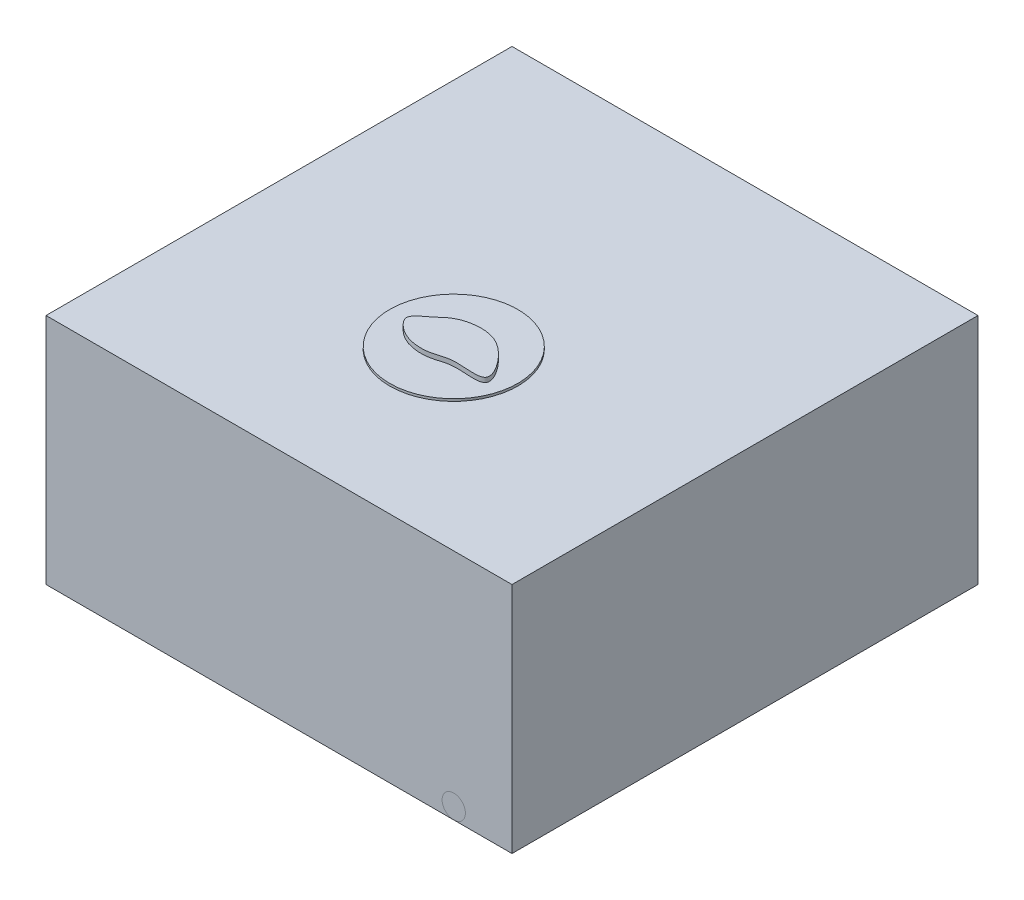
ISO-10303-21;
HEADER;
FILE_DESCRIPTION(('STEP AP214'),'2;1');
FILE_NAME('part.step','',(''),(''),'','','');
FILE_SCHEMA(('AUTOMOTIVE_DESIGN { 1 0 10303 214 1 1 1 1 }'));
ENDSEC;
DATA;
#1=APPLICATION_CONTEXT('core data for automotive mechanical design processes');
#2=APPLICATION_PROTOCOL_DEFINITION('international standard','automotive_design',2000,#1);
#3=PRODUCT_CONTEXT('',#1,'mechanical');
#4=PRODUCT('Part','Part','',(#3));
#5=PRODUCT_RELATED_PRODUCT_CATEGORY('part','',(#4));
#6=PRODUCT_DEFINITION_FORMATION('','',#4);
#7=PRODUCT_DEFINITION_CONTEXT('part definition',#1,'design');
#8=PRODUCT_DEFINITION('design','',#6,#7);
#9=PRODUCT_DEFINITION_SHAPE('','',#8);
#10=(LENGTH_UNIT() NAMED_UNIT(*) SI_UNIT(.MILLI.,.METRE.));
#11=(NAMED_UNIT(*) PLANE_ANGLE_UNIT() SI_UNIT($,.RADIAN.));
#12=(NAMED_UNIT(*) SI_UNIT($,.STERADIAN.) SOLID_ANGLE_UNIT());
#13=UNCERTAINTY_MEASURE_WITH_UNIT(LENGTH_MEASURE(1.E-05),#10,'distance_accuracy_value','');
#14=(GEOMETRIC_REPRESENTATION_CONTEXT(3) GLOBAL_UNCERTAINTY_ASSIGNED_CONTEXT((#13)) GLOBAL_UNIT_ASSIGNED_CONTEXT((#10,
#11,#12)) REPRESENTATION_CONTEXT('',''));
#15=CARTESIAN_POINT('',(0.,0.,0.));
#16=DIRECTION('',(0.,0.,1.));
#17=DIRECTION('',(1.,0.,0.));
#18=AXIS2_PLACEMENT_3D('',#15,#16,#17);
#19=CARTESIAN_POINT('',(-1.32978682457797,5.3,12.0470966404881));
#20=CARTESIAN_POINT('',(-1.56949938233388,5.3,12.2405123536894));
#21=CARTESIAN_POINT('',(-2.08614424851907,5.3,12.5391697720833));
#22=CARTESIAN_POINT('',(-1.58643209411403,5.3,13.1168891119311));
#23=CARTESIAN_POINT('',(-0.99479110722871,5.3,13.4609601521511));
#24=CARTESIAN_POINT('',(-0.122057096544853,5.3,13.5063472457396));
#25=CARTESIAN_POINT('',(0.780549472015395,5.3,13.1044677868928));
#26=CARTESIAN_POINT('',(2.65290980881673,5.3,13.5718372621998));
#27=CARTESIAN_POINT('',(1.37260667116618,5.3,11.7465735610997));
#28=CARTESIAN_POINT('',(0.251281573482777,5.3,11.3225744749199));
#29=CARTESIAN_POINT('',(-0.824147776626976,5.3,11.5489578340658));
#30=CARTESIAN_POINT('',(-1.19634203116918,5.3,11.9394246848268));
#31=CARTESIAN_POINT('',(-1.32978682457797,5.3,12.0470966404881));
#32=B_SPLINE_CURVE_WITH_KNOTS('',3,(#19,#20,#21,#22,#23,#24,#25,#26,#27,#28,#29,#30,#31),
.UNSPECIFIED.,.T.,.F.,(4,1,1,1,1,1,1,1,1,1,4),(0.,0.0890314863366276,0.133435272323839,
0.204833870138696,0.315562123210451,0.38661889368764,0.538438655581061,0.696738525235763,
0.817182112999442,0.95043735542146,1.),.UNSPECIFIED.);
#33=DIRECTION('',(0.,-1.,0.));
#34=VECTOR('',#33,1.);
#35=SURFACE_OF_LINEAR_EXTRUSION('',#32,#34);
#36=CARTESIAN_POINT('',(-1.32978682457797,5.3,12.0470966404881));
#37=VERTEX_POINT('',#36);
#38=EDGE_CURVE('E11',#37,#37,#32,.T.);
#39=ORIENTED_EDGE('',*,*,#38,.F.);
#40=EDGE_LOOP('',(#39));
#41=FACE_BOUND('',#40,.T.);
#42=CARTESIAN_POINT('',(-1.32978682457797,5.,12.0470966404881));
#43=CARTESIAN_POINT('',(-1.56949938233388,5.,12.2405123536894));
#44=CARTESIAN_POINT('',(-2.08614424851907,5.,12.5391697720833));
#45=CARTESIAN_POINT('',(-1.58643209411403,5.,13.1168891119311));
#46=CARTESIAN_POINT('',(-0.99479110722871,5.,13.4609601521511));
#47=CARTESIAN_POINT('',(-0.122057096544853,5.,13.5063472457396));
#48=CARTESIAN_POINT('',(0.780549472015395,5.,13.1044677868928));
#49=CARTESIAN_POINT('',(2.65290980881673,5.,13.5718372621998));
#50=CARTESIAN_POINT('',(1.37260667116618,5.,11.7465735610997));
#51=CARTESIAN_POINT('',(0.251281573482777,5.,11.3225744749199));
#52=CARTESIAN_POINT('',(-0.824147776626976,5.,11.5489578340658));
#53=CARTESIAN_POINT('',(-1.19634203116918,5.,11.9394246848268));
#54=CARTESIAN_POINT('',(-1.32978682457797,5.,12.0470966404881));
#55=B_SPLINE_CURVE_WITH_KNOTS('',3,(#42,#43,#44,#45,#46,#47,#48,#49,#50,#51,#52,#53,#54),
.UNSPECIFIED.,.T.,.F.,(4,1,1,1,1,1,1,1,1,1,4),(0.,0.0890314863366276,0.133435272323839,
0.204833870138696,0.315562123210451,0.38661889368764,0.538438655581061,0.696738525235763,
0.817182112999442,0.95043735542146,1.),.UNSPECIFIED.);
#56=CARTESIAN_POINT('',(-1.32978682457797,5.,12.0470966404881));
#57=VERTEX_POINT('',#56);
#58=EDGE_CURVE('E45',#57,#57,#55,.T.);
#59=ORIENTED_EDGE('',*,*,#58,.T.);
#60=EDGE_LOOP('',(#59));
#61=FACE_BOUND('',#60,.T.);
#62=ADVANCED_FACE('F41',(#41,#61),#35,.F.);
#63=CARTESIAN_POINT('',(1.81422588975815,5.3,13.257386496687));
#64=DIRECTION('',(0.,-1.,0.));
#65=DIRECTION('',(0.,0.,-1.));
#66=AXIS2_PLACEMENT_3D('',#63,#64,#65);
#67=PLANE('',#66);
#68=ORIENTED_EDGE('',*,*,#38,.T.);
#69=EDGE_LOOP('',(#68));
#70=FACE_BOUND('',#69,.T.);
#71=ADVANCED_FACE('F64',(#70),#67,.F.);
#72=CARTESIAN_POINT('',(1.81422588975815,5.,13.257386496687));
#73=DIRECTION('',(0.,-1.,0.));
#74=DIRECTION('',(0.,0.,-1.));
#75=AXIS2_PLACEMENT_3D('',#72,#73,#74);
#76=PLANE('',#75);
#77=ORIENTED_EDGE('',*,*,#58,.F.);
#78=EDGE_LOOP('',(#77));
#79=FACE_BOUND('',#78,.T.);
#80=ADVANCED_FACE('F62',(#79),#76,.T.);
#81=CLOSED_SHELL('',(#62,#71,#80));
#82=MANIFOLD_SOLID_BREP('B2',#81);
#83=CARTESIAN_POINT('',(0.5,5.,12.5));
#84=DIRECTION('',(0.,1.,0.));
#85=DIRECTION('',(0.,0.,1.));
#86=AXIS2_PLACEMENT_3D('',#83,#84,#85);
#87=CYLINDRICAL_SURFACE('',#86,0.00500000000000103);
#88=CARTESIAN_POINT('',(0.5,5.,12.5));
#89=DIRECTION('',(0.,-1.,0.));
#90=DIRECTION('',(0.,0.,1.));
#91=AXIS2_PLACEMENT_3D('',#88,#89,#90);
#92=CIRCLE('',#91,0.00500000000000103);
#93=CARTESIAN_POINT('',(0.5,5.,12.505));
#94=VERTEX_POINT('',#93);
#95=EDGE_CURVE('E40',#94,#94,#92,.T.);
#96=ORIENTED_EDGE('',*,*,#95,.F.);
#97=EDGE_LOOP('',(#96));
#98=FACE_BOUND('',#97,.T.);
#99=CARTESIAN_POINT('',(0.5,5.1,12.5));
#100=DIRECTION('',(0.,-1.,0.));
#101=DIRECTION('',(0.,0.,1.));
#102=AXIS2_PLACEMENT_3D('',#99,#100,#101);
#103=CIRCLE('',#102,0.00500000000000103);
#104=CARTESIAN_POINT('',(0.5,5.1,12.505));
#105=VERTEX_POINT('',#104);
#106=EDGE_CURVE('E103',#105,#105,#103,.T.);
#107=ORIENTED_EDGE('',*,*,#106,.T.);
#108=EDGE_LOOP('',(#107));
#109=FACE_BOUND('',#108,.T.);
#110=ADVANCED_FACE('F100',(#98,#109),#87,.T.);
#111=CARTESIAN_POINT('',(0.5,5.,12.5));
#112=DIRECTION('',(0.,1.,0.));
#113=DIRECTION('',(0.,0.,1.));
#114=AXIS2_PLACEMENT_3D('',#111,#112,#113);
#115=PLANE('',#114);
#116=ORIENTED_EDGE('',*,*,#95,.T.);
#117=EDGE_LOOP('',(#116));
#118=FACE_BOUND('',#117,.T.);
#119=ADVANCED_FACE('F115',(#118),#115,.F.);
#120=CARTESIAN_POINT('',(0.5,5.1,12.5));
#121=DIRECTION('',(0.,1.,0.));
#122=DIRECTION('',(0.,0.,1.));
#123=AXIS2_PLACEMENT_3D('',#120,#121,#122);
#124=PLANE('',#123);
#125=ORIENTED_EDGE('',*,*,#106,.F.);
#126=EDGE_LOOP('',(#125));
#127=FACE_BOUND('',#126,.T.);
#128=ADVANCED_FACE('F113',(#127),#124,.T.);
#129=CLOSED_SHELL('',(#110,#119,#128));
#130=MANIFOLD_SOLID_BREP('B6',#129);
#131=CARTESIAN_POINT('',(0.499999999999998,5.,12.));
#132=DIRECTION('',(0.,1.,0.));
#133=DIRECTION('',(0.,0.,1.));
#134=AXIS2_PLACEMENT_3D('',#131,#132,#133);
#135=CYLINDRICAL_SURFACE('',#134,0.00499999999999896);
#136=CARTESIAN_POINT('',(0.499999999999998,5.,12.));
#137=DIRECTION('',(0.,-1.,0.));
#138=DIRECTION('',(0.,0.,1.));
#139=AXIS2_PLACEMENT_3D('',#136,#137,#138);
#140=CIRCLE('',#139,0.00499999999999896);
#141=CARTESIAN_POINT('',(0.499999999999998,5.,12.005));
#142=VERTEX_POINT('',#141);
#143=EDGE_CURVE('E99',#142,#142,#140,.T.);
#144=ORIENTED_EDGE('',*,*,#143,.F.);
#145=EDGE_LOOP('',(#144));
#146=FACE_BOUND('',#145,.T.);
#147=CARTESIAN_POINT('',(0.499999999999998,5.1,12.));
#148=DIRECTION('',(0.,-1.,0.));
#149=DIRECTION('',(0.,0.,1.));
#150=AXIS2_PLACEMENT_3D('',#147,#148,#149);
#151=CIRCLE('',#150,0.00499999999999896);
#152=CARTESIAN_POINT('',(0.499999999999998,5.1,12.005));
#153=VERTEX_POINT('',#152);
#154=EDGE_CURVE('E151',#153,#153,#151,.T.);
#155=ORIENTED_EDGE('',*,*,#154,.T.);
#156=EDGE_LOOP('',(#155));
#157=FACE_BOUND('',#156,.T.);
#158=ADVANCED_FACE('F148',(#146,#157),#135,.T.);
#159=CARTESIAN_POINT('',(0.499999999999998,5.,12.));
#160=DIRECTION('',(0.,1.,0.));
#161=DIRECTION('',(0.,0.,1.));
#162=AXIS2_PLACEMENT_3D('',#159,#160,#161);
#163=PLANE('',#162);
#164=ORIENTED_EDGE('',*,*,#143,.T.);
#165=EDGE_LOOP('',(#164));
#166=FACE_BOUND('',#165,.T.);
#167=ADVANCED_FACE('F163',(#166),#163,.F.);
#168=CARTESIAN_POINT('',(0.499999999999998,5.1,12.));
#169=DIRECTION('',(0.,1.,0.));
#170=DIRECTION('',(0.,0.,1.));
#171=AXIS2_PLACEMENT_3D('',#168,#169,#170);
#172=PLANE('',#171);
#173=ORIENTED_EDGE('',*,*,#154,.F.);
#174=EDGE_LOOP('',(#173));
#175=FACE_BOUND('',#174,.T.);
#176=ADVANCED_FACE('F161',(#175),#172,.T.);
#177=CLOSED_SHELL('',(#158,#167,#176));
#178=MANIFOLD_SOLID_BREP('B35',#177);
#179=CARTESIAN_POINT('',(0.499999999999998,5.,13.));
#180=DIRECTION('',(0.,1.,0.));
#181=DIRECTION('',(0.,0.,1.));
#182=AXIS2_PLACEMENT_3D('',#179,#180,#181);
#183=CYLINDRICAL_SURFACE('',#182,0.00500000000000103);
#184=CARTESIAN_POINT('',(0.499999999999998,5.,13.));
#185=DIRECTION('',(0.,-1.,0.));
#186=DIRECTION('',(0.,0.,-1.));
#187=AXIS2_PLACEMENT_3D('',#184,#185,#186);
#188=CIRCLE('',#187,0.00500000000000103);
#189=CARTESIAN_POINT('',(0.499999999999998,5.,12.995));
#190=VERTEX_POINT('',#189);
#191=EDGE_CURVE('E147',#190,#190,#188,.T.);
#192=ORIENTED_EDGE('',*,*,#191,.F.);
#193=EDGE_LOOP('',(#192));
#194=FACE_BOUND('',#193,.T.);
#195=CARTESIAN_POINT('',(0.499999999999998,5.1,13.));
#196=DIRECTION('',(0.,-1.,0.));
#197=DIRECTION('',(0.,0.,-1.));
#198=AXIS2_PLACEMENT_3D('',#195,#196,#197);
#199=CIRCLE('',#198,0.00500000000000103);
#200=CARTESIAN_POINT('',(0.499999999999998,5.1,12.995));
#201=VERTEX_POINT('',#200);
#202=EDGE_CURVE('E199',#201,#201,#199,.T.);
#203=ORIENTED_EDGE('',*,*,#202,.T.);
#204=EDGE_LOOP('',(#203));
#205=FACE_BOUND('',#204,.T.);
#206=ADVANCED_FACE('F196',(#194,#205),#183,.T.);
#207=CARTESIAN_POINT('',(0.499999999999998,5.,13.));
#208=DIRECTION('',(0.,-1.,0.));
#209=DIRECTION('',(0.,0.,-1.));
#210=AXIS2_PLACEMENT_3D('',#207,#208,#209);
#211=PLANE('',#210);
#212=ORIENTED_EDGE('',*,*,#191,.T.);
#213=EDGE_LOOP('',(#212));
#214=FACE_BOUND('',#213,.T.);
#215=ADVANCED_FACE('F211',(#214),#211,.T.);
#216=CARTESIAN_POINT('',(0.499999999999998,5.1,13.));
#217=DIRECTION('',(0.,-1.,0.));
#218=DIRECTION('',(0.,0.,-1.));
#219=AXIS2_PLACEMENT_3D('',#216,#217,#218);
#220=PLANE('',#219);
#221=ORIENTED_EDGE('',*,*,#202,.F.);
#222=EDGE_LOOP('',(#221));
#223=FACE_BOUND('',#222,.T.);
#224=ADVANCED_FACE('F209',(#223),#220,.F.);
#225=CLOSED_SHELL('',(#206,#215,#224));
#226=MANIFOLD_SOLID_BREP('B94',#225);
#227=CARTESIAN_POINT('',(0.,5.,13.));
#228=DIRECTION('',(0.,1.,0.));
#229=DIRECTION('',(0.,0.,1.));
#230=AXIS2_PLACEMENT_3D('',#227,#228,#229);
#231=CYLINDRICAL_SURFACE('',#230,0.00500000000000099);
#232=CARTESIAN_POINT('',(0.,5.,13.));
#233=DIRECTION('',(0.,-1.,0.));
#234=DIRECTION('',(0.,0.,1.));
#235=AXIS2_PLACEMENT_3D('',#232,#233,#234);
#236=CIRCLE('',#235,0.00500000000000099);
#237=CARTESIAN_POINT('',(0.,5.,13.005));
#238=VERTEX_POINT('',#237);
#239=EDGE_CURVE('E195',#238,#238,#236,.T.);
#240=ORIENTED_EDGE('',*,*,#239,.F.);
#241=EDGE_LOOP('',(#240));
#242=FACE_BOUND('',#241,.T.);
#243=CARTESIAN_POINT('',(0.,5.1,13.));
#244=DIRECTION('',(0.,-1.,0.));
#245=DIRECTION('',(0.,0.,1.));
#246=AXIS2_PLACEMENT_3D('',#243,#244,#245);
#247=CIRCLE('',#246,0.00500000000000099);
#248=CARTESIAN_POINT('',(0.,5.1,13.005));
#249=VERTEX_POINT('',#248);
#250=EDGE_CURVE('E247',#249,#249,#247,.T.);
#251=ORIENTED_EDGE('',*,*,#250,.T.);
#252=EDGE_LOOP('',(#251));
#253=FACE_BOUND('',#252,.T.);
#254=ADVANCED_FACE('F244',(#242,#253),#231,.T.);
#255=CARTESIAN_POINT('',(0.,5.,13.));
#256=DIRECTION('',(0.,1.,0.));
#257=DIRECTION('',(0.,0.,1.));
#258=AXIS2_PLACEMENT_3D('',#255,#256,#257);
#259=PLANE('',#258);
#260=ORIENTED_EDGE('',*,*,#239,.T.);
#261=EDGE_LOOP('',(#260));
#262=FACE_BOUND('',#261,.T.);
#263=ADVANCED_FACE('F259',(#262),#259,.F.);
#264=CARTESIAN_POINT('',(0.,5.1,13.));
#265=DIRECTION('',(0.,1.,0.));
#266=DIRECTION('',(0.,0.,1.));
#267=AXIS2_PLACEMENT_3D('',#264,#265,#266);
#268=PLANE('',#267);
#269=ORIENTED_EDGE('',*,*,#250,.F.);
#270=EDGE_LOOP('',(#269));
#271=FACE_BOUND('',#270,.T.);
#272=ADVANCED_FACE('F257',(#271),#268,.T.);
#273=CLOSED_SHELL('',(#254,#263,#272));
#274=MANIFOLD_SOLID_BREP('B142',#273);
#275=CARTESIAN_POINT('',(-0.499999999999998,5.,13.));
#276=DIRECTION('',(0.,1.,0.));
#277=DIRECTION('',(0.,0.,1.));
#278=AXIS2_PLACEMENT_3D('',#275,#276,#277);
#279=CYLINDRICAL_SURFACE('',#278,0.00500000000000103);
#280=CARTESIAN_POINT('',(-0.499999999999998,5.,13.));
#281=DIRECTION('',(0.,-1.,0.));
#282=DIRECTION('',(0.,0.,1.));
#283=AXIS2_PLACEMENT_3D('',#280,#281,#282);
#284=CIRCLE('',#283,0.00500000000000103);
#285=CARTESIAN_POINT('',(-0.499999999999998,5.,13.005));
#286=VERTEX_POINT('',#285);
#287=EDGE_CURVE('E243',#286,#286,#284,.T.);
#288=ORIENTED_EDGE('',*,*,#287,.F.);
#289=EDGE_LOOP('',(#288));
#290=FACE_BOUND('',#289,.T.);
#291=CARTESIAN_POINT('',(-0.499999999999998,5.1,13.));
#292=DIRECTION('',(0.,-1.,0.));
#293=DIRECTION('',(0.,0.,1.));
#294=AXIS2_PLACEMENT_3D('',#291,#292,#293);
#295=CIRCLE('',#294,0.00500000000000103);
#296=CARTESIAN_POINT('',(-0.499999999999998,5.1,13.005));
#297=VERTEX_POINT('',#296);
#298=EDGE_CURVE('E295',#297,#297,#295,.T.);
#299=ORIENTED_EDGE('',*,*,#298,.T.);
#300=EDGE_LOOP('',(#299));
#301=FACE_BOUND('',#300,.T.);
#302=ADVANCED_FACE('F292',(#290,#301),#279,.T.);
#303=CARTESIAN_POINT('',(-0.499999999999998,5.,13.));
#304=DIRECTION('',(0.,1.,0.));
#305=DIRECTION('',(0.,0.,1.));
#306=AXIS2_PLACEMENT_3D('',#303,#304,#305);
#307=PLANE('',#306);
#308=ORIENTED_EDGE('',*,*,#287,.T.);
#309=EDGE_LOOP('',(#308));
#310=FACE_BOUND('',#309,.T.);
#311=ADVANCED_FACE('F307',(#310),#307,.F.);
#312=CARTESIAN_POINT('',(-0.499999999999998,5.1,13.));
#313=DIRECTION('',(0.,1.,0.));
#314=DIRECTION('',(0.,0.,1.));
#315=AXIS2_PLACEMENT_3D('',#312,#313,#314);
#316=PLANE('',#315);
#317=ORIENTED_EDGE('',*,*,#298,.F.);
#318=EDGE_LOOP('',(#317));
#319=FACE_BOUND('',#318,.T.);
#320=ADVANCED_FACE('F305',(#319),#316,.T.);
#321=CLOSED_SHELL('',(#302,#311,#320));
#322=MANIFOLD_SOLID_BREP('B190',#321);
#323=CARTESIAN_POINT('',(0.,5.,12.));
#324=DIRECTION('',(0.,1.,0.));
#325=DIRECTION('',(0.,0.,1.));
#326=AXIS2_PLACEMENT_3D('',#323,#324,#325);
#327=CYLINDRICAL_SURFACE('',#326,0.00499999999999898);
#328=CARTESIAN_POINT('',(0.,5.,12.));
#329=DIRECTION('',(0.,-1.,0.));
#330=DIRECTION('',(0.,0.,-1.));
#331=AXIS2_PLACEMENT_3D('',#328,#329,#330);
#332=CIRCLE('',#331,0.00499999999999898);
#333=CARTESIAN_POINT('',(0.,5.,11.995));
#334=VERTEX_POINT('',#333);
#335=EDGE_CURVE('E291',#334,#334,#332,.T.);
#336=ORIENTED_EDGE('',*,*,#335,.F.);
#337=EDGE_LOOP('',(#336));
#338=FACE_BOUND('',#337,.T.);
#339=CARTESIAN_POINT('',(0.,5.1,12.));
#340=DIRECTION('',(0.,-1.,0.));
#341=DIRECTION('',(0.,0.,-1.));
#342=AXIS2_PLACEMENT_3D('',#339,#340,#341);
#343=CIRCLE('',#342,0.00499999999999898);
#344=CARTESIAN_POINT('',(0.,5.1,11.995));
#345=VERTEX_POINT('',#344);
#346=EDGE_CURVE('E343',#345,#345,#343,.T.);
#347=ORIENTED_EDGE('',*,*,#346,.T.);
#348=EDGE_LOOP('',(#347));
#349=FACE_BOUND('',#348,.T.);
#350=ADVANCED_FACE('F340',(#338,#349),#327,.T.);
#351=CARTESIAN_POINT('',(0.,5.,12.));
#352=DIRECTION('',(0.,-1.,0.));
#353=DIRECTION('',(0.,0.,-1.));
#354=AXIS2_PLACEMENT_3D('',#351,#352,#353);
#355=PLANE('',#354);
#356=ORIENTED_EDGE('',*,*,#335,.T.);
#357=EDGE_LOOP('',(#356));
#358=FACE_BOUND('',#357,.T.);
#359=ADVANCED_FACE('F355',(#358),#355,.T.);
#360=CARTESIAN_POINT('',(0.,5.1,12.));
#361=DIRECTION('',(0.,-1.,0.));
#362=DIRECTION('',(0.,0.,-1.));
#363=AXIS2_PLACEMENT_3D('',#360,#361,#362);
#364=PLANE('',#363);
#365=ORIENTED_EDGE('',*,*,#346,.F.);
#366=EDGE_LOOP('',(#365));
#367=FACE_BOUND('',#366,.T.);
#368=ADVANCED_FACE('F353',(#367),#364,.F.);
#369=CLOSED_SHELL('',(#350,#359,#368));
#370=MANIFOLD_SOLID_BREP('B238',#369);
#371=CARTESIAN_POINT('',(-0.499999999999998,5.,12.));
#372=DIRECTION('',(0.,1.,0.));
#373=DIRECTION('',(0.,0.,1.));
#374=AXIS2_PLACEMENT_3D('',#371,#372,#373);
#375=CYLINDRICAL_SURFACE('',#374,0.00499999999999896);
#376=CARTESIAN_POINT('',(-0.499999999999998,5.,12.));
#377=DIRECTION('',(0.,-1.,0.));
#378=DIRECTION('',(0.,0.,-1.));
#379=AXIS2_PLACEMENT_3D('',#376,#377,#378);
#380=CIRCLE('',#379,0.00499999999999896);
#381=CARTESIAN_POINT('',(-0.499999999999998,5.,11.995));
#382=VERTEX_POINT('',#381);
#383=EDGE_CURVE('E339',#382,#382,#380,.T.);
#384=ORIENTED_EDGE('',*,*,#383,.F.);
#385=EDGE_LOOP('',(#384));
#386=FACE_BOUND('',#385,.T.);
#387=CARTESIAN_POINT('',(-0.499999999999998,5.1,12.));
#388=DIRECTION('',(0.,-1.,0.));
#389=DIRECTION('',(0.,0.,-1.));
#390=AXIS2_PLACEMENT_3D('',#387,#388,#389);
#391=CIRCLE('',#390,0.00499999999999896);
#392=CARTESIAN_POINT('',(-0.499999999999998,5.1,11.995));
#393=VERTEX_POINT('',#392);
#394=EDGE_CURVE('E391',#393,#393,#391,.T.);
#395=ORIENTED_EDGE('',*,*,#394,.T.);
#396=EDGE_LOOP('',(#395));
#397=FACE_BOUND('',#396,.T.);
#398=ADVANCED_FACE('F388',(#386,#397),#375,.T.);
#399=CARTESIAN_POINT('',(-0.499999999999998,5.,12.));
#400=DIRECTION('',(0.,-1.,0.));
#401=DIRECTION('',(0.,0.,-1.));
#402=AXIS2_PLACEMENT_3D('',#399,#400,#401);
#403=PLANE('',#402);
#404=ORIENTED_EDGE('',*,*,#383,.T.);
#405=EDGE_LOOP('',(#404));
#406=FACE_BOUND('',#405,.T.);
#407=ADVANCED_FACE('F403',(#406),#403,.T.);
#408=CARTESIAN_POINT('',(-0.499999999999998,5.1,12.));
#409=DIRECTION('',(0.,-1.,0.));
#410=DIRECTION('',(0.,0.,-1.));
#411=AXIS2_PLACEMENT_3D('',#408,#409,#410);
#412=PLANE('',#411);
#413=ORIENTED_EDGE('',*,*,#394,.F.);
#414=EDGE_LOOP('',(#413));
#415=FACE_BOUND('',#414,.T.);
#416=ADVANCED_FACE('F401',(#415),#412,.F.);
#417=CLOSED_SHELL('',(#398,#407,#416));
#418=MANIFOLD_SOLID_BREP('B286',#417);
#419=CARTESIAN_POINT('',(-0.5,5.,12.5));
#420=DIRECTION('',(0.,1.,0.));
#421=DIRECTION('',(0.,0.,1.));
#422=AXIS2_PLACEMENT_3D('',#419,#420,#421);
#423=CYLINDRICAL_SURFACE('',#422,0.00500000000000103);
#424=CARTESIAN_POINT('',(-0.5,5.,12.5));
#425=DIRECTION('',(0.,-1.,0.));
#426=DIRECTION('',(0.,0.,-1.));
#427=AXIS2_PLACEMENT_3D('',#424,#425,#426);
#428=CIRCLE('',#427,0.00500000000000103);
#429=CARTESIAN_POINT('',(-0.5,5.,12.495));
#430=VERTEX_POINT('',#429);
#431=EDGE_CURVE('E387',#430,#430,#428,.T.);
#432=ORIENTED_EDGE('',*,*,#431,.F.);
#433=EDGE_LOOP('',(#432));
#434=FACE_BOUND('',#433,.T.);
#435=CARTESIAN_POINT('',(-0.5,5.1,12.5));
#436=DIRECTION('',(0.,-1.,0.));
#437=DIRECTION('',(0.,0.,-1.));
#438=AXIS2_PLACEMENT_3D('',#435,#436,#437);
#439=CIRCLE('',#438,0.00500000000000103);
#440=CARTESIAN_POINT('',(-0.5,5.1,12.495));
#441=VERTEX_POINT('',#440);
#442=EDGE_CURVE('E439',#441,#441,#439,.T.);
#443=ORIENTED_EDGE('',*,*,#442,.T.);
#444=EDGE_LOOP('',(#443));
#445=FACE_BOUND('',#444,.T.);
#446=ADVANCED_FACE('F436',(#434,#445),#423,.T.);
#447=CARTESIAN_POINT('',(-0.5,5.,12.5));
#448=DIRECTION('',(0.,-1.,0.));
#449=DIRECTION('',(0.,0.,-1.));
#450=AXIS2_PLACEMENT_3D('',#447,#448,#449);
#451=PLANE('',#450);
#452=ORIENTED_EDGE('',*,*,#431,.T.);
#453=EDGE_LOOP('',(#452));
#454=FACE_BOUND('',#453,.T.);
#455=ADVANCED_FACE('F451',(#454),#451,.T.);
#456=CARTESIAN_POINT('',(-0.5,5.1,12.5));
#457=DIRECTION('',(0.,-1.,0.));
#458=DIRECTION('',(0.,0.,-1.));
#459=AXIS2_PLACEMENT_3D('',#456,#457,#458);
#460=PLANE('',#459);
#461=ORIENTED_EDGE('',*,*,#442,.F.);
#462=EDGE_LOOP('',(#461));
#463=FACE_BOUND('',#462,.T.);
#464=ADVANCED_FACE('F449',(#463),#460,.F.);
#465=CLOSED_SHELL('',(#446,#455,#464));
#466=MANIFOLD_SOLID_BREP('B334',#465);
#467=CARTESIAN_POINT('',(0.,5.,12.5));
#468=DIRECTION('',(0.,1.,0.));
#469=DIRECTION('',(0.,0.,1.));
#470=AXIS2_PLACEMENT_3D('',#467,#468,#469);
#471=CYLINDRICAL_SURFACE('',#470,0.00500000000000099);
#472=CARTESIAN_POINT('',(0.,5.,12.5));
#473=DIRECTION('',(0.,-1.,0.));
#474=DIRECTION('',(0.,0.,-1.));
#475=AXIS2_PLACEMENT_3D('',#472,#473,#474);
#476=CIRCLE('',#475,0.00500000000000099);
#477=CARTESIAN_POINT('',(0.,5.,12.495));
#478=VERTEX_POINT('',#477);
#479=EDGE_CURVE('E435',#478,#478,#476,.T.);
#480=ORIENTED_EDGE('',*,*,#479,.F.);
#481=EDGE_LOOP('',(#480));
#482=FACE_BOUND('',#481,.T.);
#483=CARTESIAN_POINT('',(0.,5.1,12.5));
#484=DIRECTION('',(0.,-1.,0.));
#485=DIRECTION('',(0.,0.,-1.));
#486=AXIS2_PLACEMENT_3D('',#483,#484,#485);
#487=CIRCLE('',#486,0.00500000000000099);
#488=CARTESIAN_POINT('',(0.,5.1,12.495));
#489=VERTEX_POINT('',#488);
#490=EDGE_CURVE('E487',#489,#489,#487,.T.);
#491=ORIENTED_EDGE('',*,*,#490,.T.);
#492=EDGE_LOOP('',(#491));
#493=FACE_BOUND('',#492,.T.);
#494=ADVANCED_FACE('F484',(#482,#493),#471,.T.);
#495=CARTESIAN_POINT('',(0.,5.,12.5));
#496=DIRECTION('',(0.,-1.,0.));
#497=DIRECTION('',(0.,0.,-1.));
#498=AXIS2_PLACEMENT_3D('',#495,#496,#497);
#499=PLANE('',#498);
#500=ORIENTED_EDGE('',*,*,#479,.T.);
#501=EDGE_LOOP('',(#500));
#502=FACE_BOUND('',#501,.T.);
#503=ADVANCED_FACE('F499',(#502),#499,.T.);
#504=CARTESIAN_POINT('',(0.,5.1,12.5));
#505=DIRECTION('',(0.,-1.,0.));
#506=DIRECTION('',(0.,0.,-1.));
#507=AXIS2_PLACEMENT_3D('',#504,#505,#506);
#508=PLANE('',#507);
#509=ORIENTED_EDGE('',*,*,#490,.F.);
#510=EDGE_LOOP('',(#509));
#511=FACE_BOUND('',#510,.T.);
#512=ADVANCED_FACE('F497',(#511),#508,.F.);
#513=CLOSED_SHELL('',(#494,#503,#512));
#514=MANIFOLD_SOLID_BREP('B382',#513);
#515=CARTESIAN_POINT('',(0.,5.1,12.5));
#516=DIRECTION('',(0.,-1.,0.));
#517=DIRECTION('',(0.,0.,-1.));
#518=AXIS2_PLACEMENT_3D('',#515,#516,#517);
#519=CYLINDRICAL_SURFACE('',#518,2.75);
#520=CARTESIAN_POINT('',(0.,5.1,12.5));
#521=DIRECTION('',(0.,1.,0.));
#522=DIRECTION('',(0.,0.,1.));
#523=AXIS2_PLACEMENT_3D('',#520,#521,#522);
#524=CIRCLE('',#523,2.75);
#525=CARTESIAN_POINT('',(0.,5.1,15.25));
#526=VERTEX_POINT('',#525);
#527=EDGE_CURVE('E483',#526,#526,#524,.T.);
#528=ORIENTED_EDGE('',*,*,#527,.F.);
#529=EDGE_LOOP('',(#528));
#530=FACE_BOUND('',#529,.T.);
#531=CARTESIAN_POINT('',(0.,5.,12.5));
#532=DIRECTION('',(0.,1.,0.));
#533=DIRECTION('',(0.,0.,1.));
#534=AXIS2_PLACEMENT_3D('',#531,#532,#533);
#535=CIRCLE('',#534,2.75);
#536=CARTESIAN_POINT('',(0.,5.,15.25));
#537=VERTEX_POINT('',#536);
#538=EDGE_CURVE('E535',#537,#537,#535,.T.);
#539=ORIENTED_EDGE('',*,*,#538,.T.);
#540=EDGE_LOOP('',(#539));
#541=FACE_BOUND('',#540,.T.);
#542=ADVANCED_FACE('F532',(#530,#541),#519,.T.);
#543=CARTESIAN_POINT('',(0.,5.1,12.5));
#544=DIRECTION('',(0.,1.,0.));
#545=DIRECTION('',(0.,0.,1.));
#546=AXIS2_PLACEMENT_3D('',#543,#544,#545);
#547=PLANE('',#546);
#548=ORIENTED_EDGE('',*,*,#527,.T.);
#549=EDGE_LOOP('',(#548));
#550=FACE_BOUND('',#549,.T.);
#551=ADVANCED_FACE('F547',(#550),#547,.T.);
#552=CARTESIAN_POINT('',(0.,5.,12.5));
#553=DIRECTION('',(0.,1.,0.));
#554=DIRECTION('',(0.,0.,1.));
#555=AXIS2_PLACEMENT_3D('',#552,#553,#554);
#556=PLANE('',#555);
#557=ORIENTED_EDGE('',*,*,#538,.F.);
#558=EDGE_LOOP('',(#557));
#559=FACE_BOUND('',#558,.T.);
#560=ADVANCED_FACE('F545',(#559),#556,.F.);
#561=CLOSED_SHELL('',(#542,#551,#560));
#562=MANIFOLD_SOLID_BREP('B430',#561);
#563=CARTESIAN_POINT('',(7.5,-4.5,20.));
#564=DIRECTION('',(0.,0.,-1.));
#565=DIRECTION('',(-1.,0.,0.));
#566=AXIS2_PLACEMENT_3D('',#563,#564,#565);
#567=PLANE('',#566);
#568=CARTESIAN_POINT('',(7.5,-4.5,20.));
#569=DIRECTION('',(0.,0.,1.));
#570=DIRECTION('',(-1.,0.,0.));
#571=AXIS2_PLACEMENT_3D('',#568,#569,#570);
#572=CIRCLE('',#571,0.500000000000004);
#573=CARTESIAN_POINT('',(7.,-4.5,20.));
#574=VERTEX_POINT('',#573);
#575=EDGE_CURVE('E594',#574,#574,#572,.T.);
#576=ORIENTED_EDGE('',*,*,#575,.T.);
#577=EDGE_LOOP('',(#576));
#578=FACE_BOUND('',#577,.T.);
#579=ADVANCED_FACE('F580',(#578),#567,.F.);
#580=CARTESIAN_POINT('',(7.5,5.,4.));
#581=DIRECTION('',(0.,1.,0.));
#582=DIRECTION('',(-1.,0.,0.));
#583=AXIS2_PLACEMENT_3D('',#580,#581,#582);
#584=PLANE('',#583);
#585=CARTESIAN_POINT('',(7.5,5.,4.));
#586=DIRECTION('',(0.,-1.,0.));
#587=DIRECTION('',(-1.,0.,0.));
#588=AXIS2_PLACEMENT_3D('',#585,#586,#587);
#589=CIRCLE('',#588,0.500000000000004);
#590=CARTESIAN_POINT('',(7.,5.,4.));
#591=VERTEX_POINT('',#590);
#592=EDGE_CURVE('E531',#591,#591,#589,.T.);
#593=ORIENTED_EDGE('',*,*,#592,.F.);
#594=EDGE_LOOP('',(#593));
#595=FACE_BOUND('',#594,.T.);
#596=ADVANCED_FACE('F604',(#595),#584,.T.);
#597=CARTESIAN_POINT('',(7.5,-4.5,20.));
#598=DIRECTION('',(0.,0.,-1.));
#599=DIRECTION('',(-1.,0.,0.));
#600=AXIS2_PLACEMENT_3D('',#597,#598,#599);
#601=CYLINDRICAL_SURFACE('',#600,0.500000000000004);
#602=CARTESIAN_POINT('',(7.5,-4.5,5.));
#603=DIRECTION('',(0.,0.,1.));
#604=DIRECTION('',(-1.,0.,0.));
#605=AXIS2_PLACEMENT_3D('',#602,#603,#604);
#606=CIRCLE('',#605,0.500000000000004);
#607=CARTESIAN_POINT('',(7.5,-5.,5.));
#608=VERTEX_POINT('',#607);
#609=EDGE_CURVE('E590',#608,#608,#606,.T.);
#610=ORIENTED_EDGE('',*,*,#609,.T.);
#611=EDGE_LOOP('',(#610));
#612=FACE_BOUND('',#611,.T.);
#613=ORIENTED_EDGE('',*,*,#575,.F.);
#614=EDGE_LOOP('',(#613));
#615=FACE_BOUND('',#614,.T.);
#616=ADVANCED_FACE('F601',(#612,#615),#601,.T.);
#617=CARTESIAN_POINT('',(7.5,-3.5,5.));
#618=DIRECTION('',(1.,0.,0.));
#619=DIRECTION('',(0.,0.,-1.));
#620=AXIS2_PLACEMENT_3D('',#617,#618,#619);
#621=TOROIDAL_SURFACE('',#620,1.,0.500000000000004);
#622=CARTESIAN_POINT('',(7.5,-3.5,4.));
#623=DIRECTION('',(0.,-1.,0.));
#624=DIRECTION('',(-1.,0.,0.));
#625=AXIS2_PLACEMENT_3D('',#622,#623,#624);
#626=CIRCLE('',#625,0.500000000000004);
#627=CARTESIAN_POINT('',(7.5,-3.5,3.5));
#628=VERTEX_POINT('',#627);
#629=EDGE_CURVE('E586',#628,#628,#626,.T.);
#630=CARTESIAN_POINT('',(7.5,-3.5,5.));
#631=DIRECTION('',(1.,0.,0.));
#632=DIRECTION('',(0.,0.,-1.));
#633=AXIS2_PLACEMENT_3D('',#630,#631,#632);
#634=CIRCLE('',#633,1.5);
#635=EDGE_CURVE('',#608,#628,#634,.T.);
#636=ORIENTED_EDGE('',*,*,#609,.F.);
#637=ORIENTED_EDGE('',*,*,#629,.T.);
#638=ORIENTED_EDGE('',*,*,#635,.T.);
#639=ORIENTED_EDGE('',*,*,#635,.F.);
#640=EDGE_LOOP('',(#636,#638,#637,#639));
#641=FACE_BOUND('',#640,.T.);
#642=ADVANCED_FACE('F603',(#641),#621,.T.);
#643=CARTESIAN_POINT('',(7.5,-3.5,4.));
#644=DIRECTION('',(0.,1.,0.));
#645=DIRECTION('',(0.,0.,1.));
#646=AXIS2_PLACEMENT_3D('',#643,#644,#645);
#647=CYLINDRICAL_SURFACE('',#646,0.500000000000004);
#648=ORIENTED_EDGE('',*,*,#592,.T.);
#649=EDGE_LOOP('',(#648));
#650=FACE_BOUND('',#649,.T.);
#651=ORIENTED_EDGE('',*,*,#629,.F.);
#652=EDGE_LOOP('',(#651));
#653=FACE_BOUND('',#652,.T.);
#654=ADVANCED_FACE('F611',(#650,#653),#647,.T.);
#655=CLOSED_SHELL('',(#579,#596,#616,#642,#654));
#656=MANIFOLD_SOLID_BREP('B478',#655);
#657=CARTESIAN_POINT('',(-7.5,-4.5,20.));
#658=DIRECTION('',(0.,0.,1.));
#659=DIRECTION('',(1.,0.,0.));
#660=AXIS2_PLACEMENT_3D('',#657,#658,#659);
#661=PLANE('',#660);
#662=CARTESIAN_POINT('',(-7.5,-4.5,20.));
#663=DIRECTION('',(0.,0.,1.));
#664=DIRECTION('',(1.,0.,0.));
#665=AXIS2_PLACEMENT_3D('',#662,#663,#664);
#666=CIRCLE('',#665,0.500000000000002);
#667=CARTESIAN_POINT('',(-7.,-4.5,20.));
#668=VERTEX_POINT('',#667);
#669=EDGE_CURVE('E673',#668,#668,#666,.T.);
#670=ORIENTED_EDGE('',*,*,#669,.T.);
#671=EDGE_LOOP('',(#670));
#672=FACE_BOUND('',#671,.T.);
#673=ADVANCED_FACE('F659',(#672),#661,.T.);
#674=CARTESIAN_POINT('',(-7.5,5.,4.));
#675=DIRECTION('',(0.,-1.,0.));
#676=DIRECTION('',(1.,0.,0.));
#677=AXIS2_PLACEMENT_3D('',#674,#675,#676);
#678=PLANE('',#677);
#679=CARTESIAN_POINT('',(-7.5,5.,4.));
#680=DIRECTION('',(0.,-1.,0.));
#681=DIRECTION('',(1.,0.,0.));
#682=AXIS2_PLACEMENT_3D('',#679,#680,#681);
#683=CIRCLE('',#682,0.500000000000002);
#684=CARTESIAN_POINT('',(-7.,5.,4.));
#685=VERTEX_POINT('',#684);
#686=EDGE_CURVE('E579',#685,#685,#683,.T.);
#687=ORIENTED_EDGE('',*,*,#686,.F.);
#688=EDGE_LOOP('',(#687));
#689=FACE_BOUND('',#688,.T.);
#690=ADVANCED_FACE('F683',(#689),#678,.F.);
#691=CARTESIAN_POINT('',(-7.5,-4.5,20.));
#692=DIRECTION('',(0.,0.,-1.));
#693=DIRECTION('',(-1.,0.,0.));
#694=AXIS2_PLACEMENT_3D('',#691,#692,#693);
#695=CYLINDRICAL_SURFACE('',#694,0.500000000000002);
#696=CARTESIAN_POINT('',(-7.5,-4.5,5.));
#697=DIRECTION('',(0.,0.,1.));
#698=DIRECTION('',(1.,0.,0.));
#699=AXIS2_PLACEMENT_3D('',#696,#697,#698);
#700=CIRCLE('',#699,0.500000000000002);
#701=CARTESIAN_POINT('',(-7.5,-5.,5.));
#702=VERTEX_POINT('',#701);
#703=EDGE_CURVE('E669',#702,#702,#700,.T.);
#704=ORIENTED_EDGE('',*,*,#703,.T.);
#705=EDGE_LOOP('',(#704));
#706=FACE_BOUND('',#705,.T.);
#707=ORIENTED_EDGE('',*,*,#669,.F.);
#708=EDGE_LOOP('',(#707));
#709=FACE_BOUND('',#708,.T.);
#710=ADVANCED_FACE('F680',(#706,#709),#695,.T.);
#711=CARTESIAN_POINT('',(-7.5,-3.5,5.));
#712=DIRECTION('',(1.,0.,0.));
#713=DIRECTION('',(0.,0.,-1.));
#714=AXIS2_PLACEMENT_3D('',#711,#712,#713);
#715=TOROIDAL_SURFACE('',#714,1.,0.500000000000002);
#716=CARTESIAN_POINT('',(-7.5,-3.5,4.));
#717=DIRECTION('',(0.,-1.,0.));
#718=DIRECTION('',(1.,0.,0.));
#719=AXIS2_PLACEMENT_3D('',#716,#717,#718);
#720=CIRCLE('',#719,0.500000000000002);
#721=CARTESIAN_POINT('',(-7.5,-3.5,3.5));
#722=VERTEX_POINT('',#721);
#723=EDGE_CURVE('E665',#722,#722,#720,.T.);
#724=CARTESIAN_POINT('',(-7.5,-3.5,5.));
#725=DIRECTION('',(1.,0.,0.));
#726=DIRECTION('',(0.,0.,-1.));
#727=AXIS2_PLACEMENT_3D('',#724,#725,#726);
#728=CIRCLE('',#727,1.5);
#729=EDGE_CURVE('',#702,#722,#728,.T.);
#730=ORIENTED_EDGE('',*,*,#703,.F.);
#731=ORIENTED_EDGE('',*,*,#723,.T.);
#732=ORIENTED_EDGE('',*,*,#729,.T.);
#733=ORIENTED_EDGE('',*,*,#729,.F.);
#734=EDGE_LOOP('',(#730,#732,#731,#733));
#735=FACE_BOUND('',#734,.T.);
#736=ADVANCED_FACE('F682',(#735),#715,.T.);
#737=CARTESIAN_POINT('',(-7.5,-3.5,4.));
#738=DIRECTION('',(0.,1.,0.));
#739=DIRECTION('',(0.,0.,1.));
#740=AXIS2_PLACEMENT_3D('',#737,#738,#739);
#741=CYLINDRICAL_SURFACE('',#740,0.500000000000002);
#742=ORIENTED_EDGE('',*,*,#686,.T.);
#743=EDGE_LOOP('',(#742));
#744=FACE_BOUND('',#743,.T.);
#745=ORIENTED_EDGE('',*,*,#723,.F.);
#746=EDGE_LOOP('',(#745));
#747=FACE_BOUND('',#746,.T.);
#748=ADVANCED_FACE('F690',(#744,#747),#741,.T.);
#749=CLOSED_SHELL('',(#673,#690,#710,#736,#748));
#750=MANIFOLD_SOLID_BREP('B526',#749);
#751=CARTESIAN_POINT('',(10.,-5.,20.));
#752=DIRECTION('',(-1.,0.,0.));
#753=DIRECTION('',(0.,0.,1.));
#754=AXIS2_PLACEMENT_3D('',#751,#752,#753);
#755=PLANE('',#754);
#756=DIRECTION('',(0.,1.,0.));
#757=VECTOR('',#756,1.);
#758=CARTESIAN_POINT('',(10.,-5.,0.));
#759=LINE('',#758,#757);
#760=CARTESIAN_POINT('',(10.,-5.,0.));
#761=VERTEX_POINT('',#760);
#762=CARTESIAN_POINT('',(10.,5.,0.));
#763=VERTEX_POINT('',#762);
#764=EDGE_CURVE('E792',#761,#763,#759,.T.);
#765=ORIENTED_EDGE('',*,*,#764,.T.);
#766=DIRECTION('',(0.,0.,-1.));
#767=VECTOR('',#766,1.);
#768=CARTESIAN_POINT('',(10.,5.,20.));
#769=LINE('',#768,#767);
#770=CARTESIAN_POINT('',(10.,5.,20.));
#771=VERTEX_POINT('',#770);
#772=EDGE_CURVE('E657',#771,#763,#769,.T.);
#773=ORIENTED_EDGE('',*,*,#772,.F.);
#774=DIRECTION('',(0.,1.,0.));
#775=VECTOR('',#774,1.);
#776=CARTESIAN_POINT('',(10.,-5.,20.));
#777=LINE('',#776,#775);
#778=CARTESIAN_POINT('',(10.,-5.,20.));
#779=VERTEX_POINT('',#778);
#780=EDGE_CURVE('E780',#779,#771,#777,.T.);
#781=ORIENTED_EDGE('',*,*,#780,.F.);
#782=DIRECTION('',(0.,0.,-1.));
#783=VECTOR('',#782,1.);
#784=CARTESIAN_POINT('',(10.,-5.,20.));
#785=LINE('',#784,#783);
#786=EDGE_CURVE('E788',#779,#761,#785,.T.);
#787=ORIENTED_EDGE('',*,*,#786,.T.);
#788=EDGE_LOOP('',(#765,#773,#781,#787));
#789=FACE_BOUND('',#788,.T.);
#790=ADVANCED_FACE('F729',(#789),#755,.F.);
#791=CARTESIAN_POINT('',(-10.,5.,20.));
#792=DIRECTION('',(0.,-1.,0.));
#793=DIRECTION('',(0.,0.,-1.));
#794=AXIS2_PLACEMENT_3D('',#791,#792,#793);
#795=PLANE('',#794);
#796=DIRECTION('',(-1.,0.,0.));
#797=VECTOR('',#796,1.);
#798=CARTESIAN_POINT('',(-10.,5.,0.));
#799=LINE('',#798,#797);
#800=CARTESIAN_POINT('',(-10.,5.,0.));
#801=VERTEX_POINT('',#800);
#802=EDGE_CURVE('E784',#763,#801,#799,.T.);
#803=ORIENTED_EDGE('',*,*,#802,.T.);
#804=DIRECTION('',(0.,0.,-1.));
#805=VECTOR('',#804,1.);
#806=CARTESIAN_POINT('',(-10.,5.,20.));
#807=LINE('',#806,#805);
#808=CARTESIAN_POINT('',(-10.,5.,20.));
#809=VERTEX_POINT('',#808);
#810=EDGE_CURVE('E737',#809,#801,#807,.T.);
#811=ORIENTED_EDGE('',*,*,#810,.F.);
#812=DIRECTION('',(-1.,0.,0.));
#813=VECTOR('',#812,1.);
#814=CARTESIAN_POINT('',(-10.,5.,20.));
#815=LINE('',#814,#813);
#816=EDGE_CURVE('E775',#771,#809,#815,.T.);
#817=ORIENTED_EDGE('',*,*,#816,.F.);
#818=ORIENTED_EDGE('',*,*,#772,.T.);
#819=EDGE_LOOP('',(#803,#811,#817,#818));
#820=FACE_BOUND('',#819,.T.);
#821=ADVANCED_FACE('F783',(#820),#795,.F.);
#822=CARTESIAN_POINT('',(-10.,-5.,20.));
#823=DIRECTION('',(1.,0.,0.));
#824=DIRECTION('',(0.,1.,0.));
#825=AXIS2_PLACEMENT_3D('',#822,#823,#824);
#826=PLANE('',#825);
#827=DIRECTION('',(0.,-1.,0.));
#828=VECTOR('',#827,1.);
#829=CARTESIAN_POINT('',(-10.,-5.,0.));
#830=LINE('',#829,#828);
#831=CARTESIAN_POINT('',(-10.,-5.,0.));
#832=VERTEX_POINT('',#831);
#833=EDGE_CURVE('E762',#801,#832,#830,.T.);
#834=ORIENTED_EDGE('',*,*,#833,.T.);
#835=DIRECTION('',(0.,0.,-1.));
#836=VECTOR('',#835,1.);
#837=CARTESIAN_POINT('',(-10.,-5.,20.));
#838=LINE('',#837,#836);
#839=CARTESIAN_POINT('',(-10.,-5.,20.));
#840=VERTEX_POINT('',#839);
#841=EDGE_CURVE('E785',#840,#832,#838,.T.);
#842=ORIENTED_EDGE('',*,*,#841,.F.);
#843=DIRECTION('',(0.,-1.,0.));
#844=VECTOR('',#843,1.);
#845=CARTESIAN_POINT('',(-10.,-5.,20.));
#846=LINE('',#845,#844);
#847=EDGE_CURVE('E778',#809,#840,#846,.T.);
#848=ORIENTED_EDGE('',*,*,#847,.F.);
#849=ORIENTED_EDGE('',*,*,#810,.T.);
#850=EDGE_LOOP('',(#834,#842,#848,#849));
#851=FACE_BOUND('',#850,.T.);
#852=ADVANCED_FACE('F786',(#851),#826,.F.);
#853=CARTESIAN_POINT('',(-10.,-5.,20.));
#854=DIRECTION('',(0.,1.,0.));
#855=DIRECTION('',(0.,0.,1.));
#856=AXIS2_PLACEMENT_3D('',#853,#854,#855);
#857=PLANE('',#856);
#858=DIRECTION('',(1.,0.,0.));
#859=VECTOR('',#858,1.);
#860=CARTESIAN_POINT('',(-10.,-5.,0.));
#861=LINE('',#860,#859);
#862=EDGE_CURVE('E768',#832,#761,#861,.T.);
#863=ORIENTED_EDGE('',*,*,#862,.T.);
#864=ORIENTED_EDGE('',*,*,#786,.F.);
#865=DIRECTION('',(1.,0.,0.));
#866=VECTOR('',#865,1.);
#867=CARTESIAN_POINT('',(-10.,-5.,20.));
#868=LINE('',#867,#866);
#869=EDGE_CURVE('E745',#840,#779,#868,.T.);
#870=ORIENTED_EDGE('',*,*,#869,.F.);
#871=ORIENTED_EDGE('',*,*,#841,.T.);
#872=EDGE_LOOP('',(#863,#864,#870,#871));
#873=FACE_BOUND('',#872,.T.);
#874=ADVANCED_FACE('F799',(#873),#857,.F.);
#875=CARTESIAN_POINT('',(0.,0.,20.));
#876=DIRECTION('',(0.,0.,-1.));
#877=DIRECTION('',(-1.,0.,0.));
#878=AXIS2_PLACEMENT_3D('',#875,#876,#877);
#879=PLANE('',#878);
#880=ORIENTED_EDGE('',*,*,#780,.T.);
#881=ORIENTED_EDGE('',*,*,#816,.T.);
#882=ORIENTED_EDGE('',*,*,#847,.T.);
#883=ORIENTED_EDGE('',*,*,#869,.T.);
#884=EDGE_LOOP('',(#880,#881,#882,#883));
#885=FACE_BOUND('',#884,.T.);
#886=ADVANCED_FACE('F776',(#885),#879,.F.);
#887=CARTESIAN_POINT('',(0.,0.,0.));
#888=DIRECTION('',(0.,0.,-1.));
#889=DIRECTION('',(-1.,0.,0.));
#890=AXIS2_PLACEMENT_3D('',#887,#888,#889);
#891=PLANE('',#890);
#892=ORIENTED_EDGE('',*,*,#764,.F.);
#893=ORIENTED_EDGE('',*,*,#862,.F.);
#894=ORIENTED_EDGE('',*,*,#833,.F.);
#895=ORIENTED_EDGE('',*,*,#802,.F.);
#896=EDGE_LOOP('',(#892,#893,#894,#895));
#897=FACE_BOUND('',#896,.T.);
#898=ADVANCED_FACE('F802',(#897),#891,.T.);
#899=CLOSED_SHELL('',(#790,#821,#852,#874,#886,#898));
#900=MANIFOLD_SOLID_BREP('B574',#899);
#901=ADVANCED_BREP_SHAPE_REPRESENTATION('',(#18,#82,#130,#178,#226,#274,#322,#370,#418,#466,
#514,#562,#656,#750,#900),#14);
#902=SHAPE_DEFINITION_REPRESENTATION(#9,#901);
ENDSEC;
END-ISO-10303-21;
